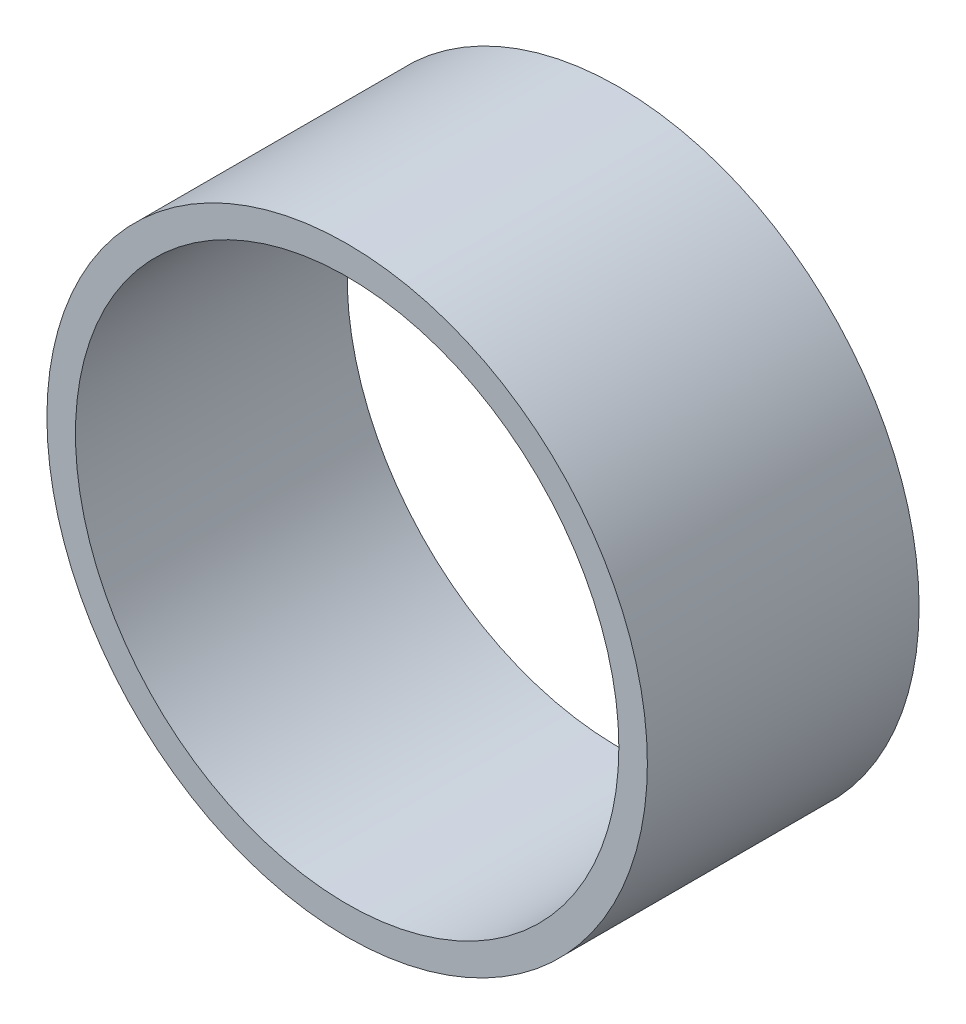
ISO-10303-21;
HEADER;
FILE_DESCRIPTION(('STEP AP214'),'2;1');
FILE_NAME('part.step','',(''),(''),'','','');
FILE_SCHEMA(('AUTOMOTIVE_DESIGN { 1 0 10303 214 1 1 1 1 }'));
ENDSEC;
DATA;
#1=APPLICATION_CONTEXT('core data for automotive mechanical design processes');
#2=APPLICATION_PROTOCOL_DEFINITION('international standard','automotive_design',2000,#1);
#3=PRODUCT_CONTEXT('',#1,'mechanical');
#4=PRODUCT('Part','Part','',(#3));
#5=PRODUCT_RELATED_PRODUCT_CATEGORY('part','',(#4));
#6=PRODUCT_DEFINITION_FORMATION('','',#4);
#7=PRODUCT_DEFINITION_CONTEXT('part definition',#1,'design');
#8=PRODUCT_DEFINITION('design','',#6,#7);
#9=PRODUCT_DEFINITION_SHAPE('','',#8);
#10=(LENGTH_UNIT() NAMED_UNIT(*) SI_UNIT(.MILLI.,.METRE.));
#11=(NAMED_UNIT(*) PLANE_ANGLE_UNIT() SI_UNIT($,.RADIAN.));
#12=(NAMED_UNIT(*) SI_UNIT($,.STERADIAN.) SOLID_ANGLE_UNIT());
#13=UNCERTAINTY_MEASURE_WITH_UNIT(LENGTH_MEASURE(1.E-05),#10,'distance_accuracy_value','');
#14=(GEOMETRIC_REPRESENTATION_CONTEXT(3) GLOBAL_UNCERTAINTY_ASSIGNED_CONTEXT((#13)) GLOBAL_UNIT_ASSIGNED_CONTEXT((#10,
#11,#12)) REPRESENTATION_CONTEXT('',''));
#15=CARTESIAN_POINT('',(0.,0.,0.));
#16=DIRECTION('',(0.,0.,1.));
#17=DIRECTION('',(1.,0.,0.));
#18=AXIS2_PLACEMENT_3D('',#15,#16,#17);
#19=CARTESIAN_POINT('',(0.,0.,4.7625));
#20=DIRECTION('',(0.,0.,1.));
#21=DIRECTION('',(1.,0.,0.));
#22=AXIS2_PLACEMENT_3D('',#19,#20,#21);
#23=PLANE('',#22);
#24=CARTESIAN_POINT('',(0.,0.,4.7625));
#25=DIRECTION('',(0.,0.,1.));
#26=DIRECTION('',(1.,0.,0.));
#27=AXIS2_PLACEMENT_3D('',#24,#25,#26);
#28=CIRCLE('',#27,5.2625);
#29=CARTESIAN_POINT('',(5.2625,0.,4.7625));
#30=VERTEX_POINT('',#29);
#31=EDGE_CURVE('E10',#30,#30,#28,.T.);
#32=ORIENTED_EDGE('',*,*,#31,.T.);
#33=EDGE_LOOP('',(#32));
#34=FACE_BOUND('',#33,.T.);
#35=CARTESIAN_POINT('',(0.,0.,4.7625));
#36=DIRECTION('',(0.,0.,1.));
#37=DIRECTION('',(1.,0.,0.));
#38=AXIS2_PLACEMENT_3D('',#35,#36,#37);
#39=CIRCLE('',#38,4.7625);
#40=CARTESIAN_POINT('',(4.7625,0.,4.7625));
#41=VERTEX_POINT('',#40);
#42=EDGE_CURVE('E48',#41,#41,#39,.T.);
#43=ORIENTED_EDGE('',*,*,#42,.F.);
#44=EDGE_LOOP('',(#43));
#45=FACE_BOUND('',#44,.T.);
#46=ADVANCED_FACE('F37',(#34,#45),#23,.T.);
#47=CARTESIAN_POINT('',(0.,0.,0.));
#48=DIRECTION('',(0.,0.,1.));
#49=DIRECTION('',(1.,0.,0.));
#50=AXIS2_PLACEMENT_3D('',#47,#48,#49);
#51=PLANE('',#50);
#52=CARTESIAN_POINT('',(0.,0.,0.));
#53=DIRECTION('',(0.,0.,1.));
#54=DIRECTION('',(1.,0.,0.));
#55=AXIS2_PLACEMENT_3D('',#52,#53,#54);
#56=CIRCLE('',#55,5.2625);
#57=CARTESIAN_POINT('',(5.2625,0.,0.));
#58=VERTEX_POINT('',#57);
#59=EDGE_CURVE('E41',#58,#58,#56,.T.);
#60=ORIENTED_EDGE('',*,*,#59,.F.);
#61=EDGE_LOOP('',(#60));
#62=FACE_BOUND('',#61,.T.);
#63=CARTESIAN_POINT('',(0.,0.,0.));
#64=DIRECTION('',(0.,0.,1.));
#65=DIRECTION('',(1.,0.,0.));
#66=AXIS2_PLACEMENT_3D('',#63,#64,#65);
#67=CIRCLE('',#66,4.7625);
#68=CARTESIAN_POINT('',(4.7625,0.,0.));
#69=VERTEX_POINT('',#68);
#70=EDGE_CURVE('E50',#69,#69,#67,.T.);
#71=ORIENTED_EDGE('',*,*,#70,.T.);
#72=EDGE_LOOP('',(#71));
#73=FACE_BOUND('',#72,.T.);
#74=ADVANCED_FACE('F60',(#62,#73),#51,.F.);
#75=CARTESIAN_POINT('',(0.,0.,4.7625));
#76=DIRECTION('',(0.,0.,-1.));
#77=DIRECTION('',(-1.,0.,0.));
#78=AXIS2_PLACEMENT_3D('',#75,#76,#77);
#79=CYLINDRICAL_SURFACE('',#78,5.2625);
#80=ORIENTED_EDGE('',*,*,#31,.F.);
#81=EDGE_LOOP('',(#80));
#82=FACE_BOUND('',#81,.T.);
#83=ORIENTED_EDGE('',*,*,#59,.T.);
#84=EDGE_LOOP('',(#83));
#85=FACE_BOUND('',#84,.T.);
#86=ADVANCED_FACE('F39',(#82,#85),#79,.T.);
#87=CARTESIAN_POINT('',(0.,0.,4.7625));
#88=DIRECTION('',(0.,0.,-1.));
#89=DIRECTION('',(-1.,0.,0.));
#90=AXIS2_PLACEMENT_3D('',#87,#88,#89);
#91=CYLINDRICAL_SURFACE('',#90,4.7625);
#92=ORIENTED_EDGE('',*,*,#42,.T.);
#93=EDGE_LOOP('',(#92));
#94=FACE_BOUND('',#93,.T.);
#95=ORIENTED_EDGE('',*,*,#70,.F.);
#96=EDGE_LOOP('',(#95));
#97=FACE_BOUND('',#96,.T.);
#98=ADVANCED_FACE('F56',(#94,#97),#91,.F.);
#99=CLOSED_SHELL('',(#46,#74,#86,#98));
#100=MANIFOLD_SOLID_BREP('B2',#99);
#101=ADVANCED_BREP_SHAPE_REPRESENTATION('',(#18,#100),#14);
#102=SHAPE_DEFINITION_REPRESENTATION(#9,#101);
ENDSEC;
END-ISO-10303-21;
